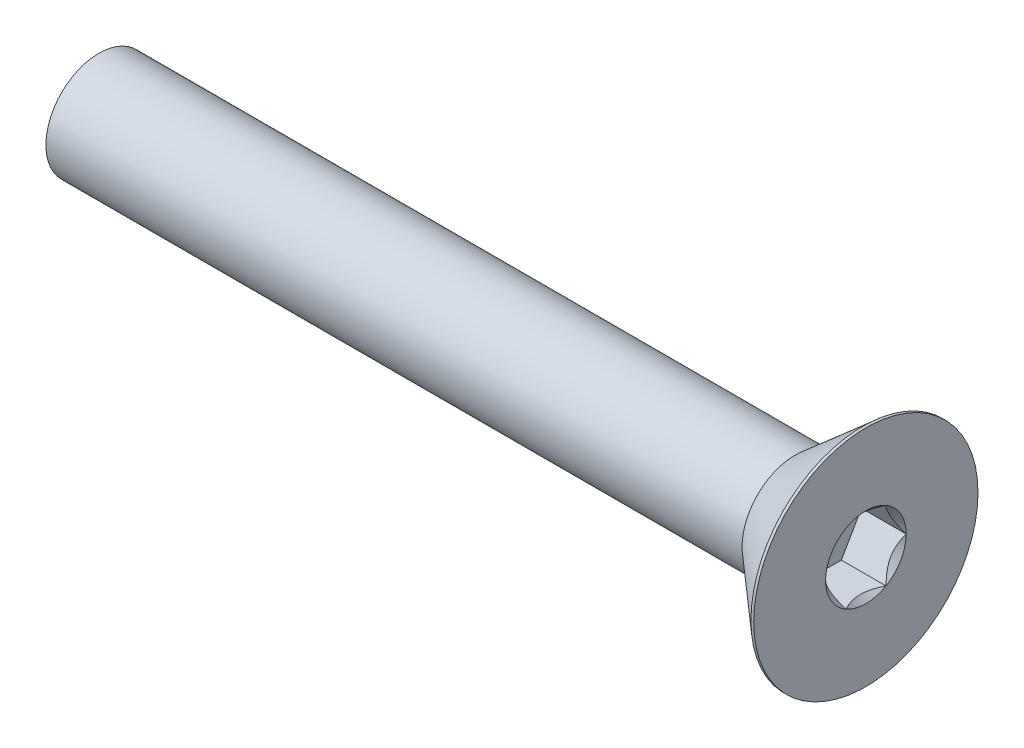
ISO-10303-21;
HEADER;
FILE_DESCRIPTION(('STEP AP214'),'2;1');
FILE_NAME('part.step','',(''),(''),'','','');
FILE_SCHEMA(('AUTOMOTIVE_DESIGN { 1 0 10303 214 1 1 1 1 }'));
ENDSEC;
DATA;
#1=APPLICATION_CONTEXT('core data for automotive mechanical design processes');
#2=APPLICATION_PROTOCOL_DEFINITION('international standard','automotive_design',2000,#1);
#3=PRODUCT_CONTEXT('',#1,'mechanical');
#4=PRODUCT('Part','Part','',(#3));
#5=PRODUCT_RELATED_PRODUCT_CATEGORY('part','',(#4));
#6=PRODUCT_DEFINITION_FORMATION('','',#4);
#7=PRODUCT_DEFINITION_CONTEXT('part definition',#1,'design');
#8=PRODUCT_DEFINITION('design','',#6,#7);
#9=PRODUCT_DEFINITION_SHAPE('','',#8);
#10=(LENGTH_UNIT() NAMED_UNIT(*) SI_UNIT(.MILLI.,.METRE.));
#11=(NAMED_UNIT(*) PLANE_ANGLE_UNIT() SI_UNIT($,.RADIAN.));
#12=(NAMED_UNIT(*) SI_UNIT($,.STERADIAN.) SOLID_ANGLE_UNIT());
#13=UNCERTAINTY_MEASURE_WITH_UNIT(LENGTH_MEASURE(1.E-05),#10,'distance_accuracy_value','');
#14=(GEOMETRIC_REPRESENTATION_CONTEXT(3) GLOBAL_UNCERTAINTY_ASSIGNED_CONTEXT((#13)) GLOBAL_UNIT_ASSIGNED_CONTEXT((#10,
#11,#12)) REPRESENTATION_CONTEXT('',''));
#15=CARTESIAN_POINT('',(0.,0.,0.));
#16=DIRECTION('',(0.,0.,1.));
#17=DIRECTION('',(1.,0.,0.));
#18=AXIS2_PLACEMENT_3D('',#15,#16,#17);
#19=CARTESIAN_POINT('',(1.193712867479,0.,0.));
#20=DIRECTION('',(1.,0.,0.));
#21=DIRECTION('',(0.,0.,-1.));
#22=AXIS2_PLACEMENT_3D('',#19,#20,#21);
#23=PLANE('',#22);
#24=DIRECTION('',(0.,-0.866025403784439,-0.5));
#25=VECTOR('',#24,1.);
#26=CARTESIAN_POINT('',(1.193712867479,-0.79375,1.3748153285078));
#27=LINE('',#26,#25);
#28=CARTESIAN_POINT('',(1.193712867479,0.,1.83308710467706));
#29=VERTEX_POINT('',#28);
#30=CARTESIAN_POINT('',(1.193712867479,-1.5875,0.916543552338532));
#31=VERTEX_POINT('',#30);
#32=EDGE_CURVE('E116',#29,#31,#27,.T.);
#33=ORIENTED_EDGE('',*,*,#32,.T.);
#34=DIRECTION('',(0.,0.,-1.));
#35=VECTOR('',#34,1.);
#36=CARTESIAN_POINT('',(1.193712867479,-1.5875,0.));
#37=LINE('',#36,#35);
#38=CARTESIAN_POINT('',(1.193712867479,-1.5875,-0.91654355233853));
#39=VERTEX_POINT('',#38);
#40=EDGE_CURVE('E83',#31,#39,#37,.T.);
#41=ORIENTED_EDGE('',*,*,#40,.T.);
#42=DIRECTION('',(0.,0.866025403784439,-0.5));
#43=VECTOR('',#42,1.);
#44=CARTESIAN_POINT('',(1.193712867479,-0.79375,-1.3748153285078));
#45=LINE('',#44,#43);
#46=CARTESIAN_POINT('',(1.193712867479,0.,-1.83308710467706));
#47=VERTEX_POINT('',#46);
#48=EDGE_CURVE('E85',#39,#47,#45,.T.);
#49=ORIENTED_EDGE('',*,*,#48,.T.);
#50=DIRECTION('',(0.,0.866025403784438,0.5));
#51=VECTOR('',#50,1.);
#52=CARTESIAN_POINT('',(1.193712867479,0.79375,-1.3748153285078));
#53=LINE('',#52,#51);
#54=CARTESIAN_POINT('',(1.193712867479,1.5875,-0.916543552338529));
#55=VERTEX_POINT('',#54);
#56=EDGE_CURVE('E86',#47,#55,#53,.T.);
#57=ORIENTED_EDGE('',*,*,#56,.T.);
#58=DIRECTION('',(0.,0.,1.));
#59=VECTOR('',#58,1.);
#60=CARTESIAN_POINT('',(1.193712867479,1.5875,0.));
#61=LINE('',#60,#59);
#62=CARTESIAN_POINT('',(1.193712867479,1.5875,0.916543552338531));
#63=VERTEX_POINT('',#62);
#64=EDGE_CURVE('E72',#55,#63,#61,.T.);
#65=ORIENTED_EDGE('',*,*,#64,.T.);
#66=DIRECTION('',(0.,-0.866025403784439,0.5));
#67=VECTOR('',#66,1.);
#68=CARTESIAN_POINT('',(1.193712867479,0.79375,1.3748153285078));
#69=LINE('',#68,#67);
#70=EDGE_CURVE('E111',#63,#29,#69,.T.);
#71=ORIENTED_EDGE('',*,*,#70,.T.);
#72=EDGE_LOOP('',(#33,#41,#49,#57,#65,#71));
#73=FACE_BOUND('',#72,.T.);
#74=ADVANCED_FACE('F18',(#73),#23,.T.);
#75=CARTESIAN_POINT('',(1.193712867479,0.79375,-1.3748153285078));
#76=DIRECTION('',(0.,0.5,-0.866025403784438));
#77=DIRECTION('',(0.,0.866025403784438,0.5));
#78=AXIS2_PLACEMENT_3D('',#75,#76,#77);
#79=PLANE('',#78);
#80=CARTESIAN_POINT('',(3.22571286750186,1.27190366490405E-11,-1.83308710467229));
#81=CARTESIAN_POINT('',(3.19424104986005,0.0545631502739884,-1.80158505517947));
#82=CARTESIAN_POINT('',(3.16461793028213,0.110038597583433,-1.76955629074127));
#83=CARTESIAN_POINT('',(3.11037926295554,0.223158727662726,-1.70424635318872));
#84=CARTESIAN_POINT('',(3.08579388372231,0.280814162284594,-1.67095897248972));
#85=CARTESIAN_POINT('',(3.04367896361078,0.39707351803509,-1.6038366021515));
#86=CARTESIAN_POINT('',(3.0260435970404,0.455647847371345,-1.57001869734156));
#87=CARTESIAN_POINT('',(2.99887295616836,0.574085662108213,-1.50163859312096));
#88=CARTESIAN_POINT('',(2.98931740761292,0.633945532003919,-1.46707848112303));
#89=CARTESIAN_POINT('',(2.98069560936949,0.737116774030597,-1.40751253676631));
#90=CARTESIAN_POINT('',(2.9794196892544,0.780294952191258,-1.38258360398213));
#91=CARTESIAN_POINT('',(2.98157200532222,0.866580665725205,-1.33276652404609));
#92=CARTESIAN_POINT('',(2.98500189035382,0.909688171036207,-1.30787839425069));
#93=CARTESIAN_POINT('',(2.99636918165353,0.995485199884442,-1.25834345654949));
#94=CARTESIAN_POINT('',(3.00431048768001,1.03817432925016,-1.23369687621872));
#95=CARTESIAN_POINT('',(3.02426914428968,1.12283605067518,-1.18481740856393));
#96=CARTESIAN_POINT('',(3.03628824374592,1.16480832716665,-1.16058470343308));
#97=CARTESIAN_POINT('',(3.0719566993385,1.27227527943506,-1.09853862961192));
#98=CARTESIAN_POINT('',(3.0982905750004,1.33710455598761,-1.06110942934294));
#99=CARTESIAN_POINT('',(3.14274348203233,1.43242888424927,-1.00607390276075));
#100=CARTESIAN_POINT('',(3.15836122675727,1.46384120989055,-0.987937988095882));
#101=CARTESIAN_POINT('',(3.19102231805198,1.52608848239935,-0.951999508556608));
#102=CARTESIAN_POINT('',(3.20806498626341,1.55692369555001,-0.934196789943556));
#103=CARTESIAN_POINT('',(3.22571286750293,1.58749999998813,-0.916543552345382));
#104=B_SPLINE_CURVE_WITH_KNOTS('',3,(#80,#81,#82,#83,#84,#85,#86,#87,#88,#89,#90,#91,#92,#93,
#94,#95,#96,#97,#98,#99,#100,#101,#102,#103),.UNSPECIFIED.,.F.,.F.,(4,2,2,2,2,2,2,2,2,2,2,4),
(0.,0.211427927693799,0.42408719707162,0.633370156309493,0.842126401366494,0.991537200904807,
1.14100036528198,1.29059292548924,1.44024972382122,1.67781721399119,1.79627069400735,
1.91466809992471),.UNSPECIFIED.);
#105=CARTESIAN_POINT('',(3.22571286750284,0.,-1.83308710467012));
#106=VERTEX_POINT('',#105);
#107=CARTESIAN_POINT('',(3.22571286750284,1.58749999999399,-0.916543552335056));
#108=VERTEX_POINT('',#107);
#109=EDGE_CURVE('E21',#106,#108,#104,.T.);
#110=ORIENTED_EDGE('',*,*,#109,.T.);
#111=DIRECTION('',(1.,0.,0.));
#112=VECTOR('',#111,1.);
#113=CARTESIAN_POINT('',(1.193712867479,1.5875,-0.916543552338529));
#114=LINE('',#113,#112);
#115=EDGE_CURVE('E91',#108,#55,#114,.F.);
#116=ORIENTED_EDGE('',*,*,#115,.T.);
#117=ORIENTED_EDGE('',*,*,#56,.F.);
#118=DIRECTION('',(1.,0.,0.));
#119=VECTOR('',#118,1.);
#120=CARTESIAN_POINT('',(1.193712867479,0.,-1.83308710467706));
#121=LINE('',#120,#119);
#122=EDGE_CURVE('E59',#47,#106,#121,.T.);
#123=ORIENTED_EDGE('',*,*,#122,.T.);
#124=EDGE_LOOP('',(#110,#116,#117,#123));
#125=FACE_BOUND('',#124,.T.);
#126=ADVANCED_FACE('F90',(#125),#79,.F.);
#127=CARTESIAN_POINT('',(1.193712867479,-0.79375,-1.3748153285078));
#128=DIRECTION('',(0.,-0.5,-0.866025403784439));
#129=DIRECTION('',(0.,0.866025403784439,-0.5));
#130=AXIS2_PLACEMENT_3D('',#127,#128,#129);
#131=PLANE('',#130);
#132=CARTESIAN_POINT('',(3.22571286750053,-1.58749999998325,-0.916543552347617));
#133=CARTESIAN_POINT('',(3.19424104985827,-1.53293684972208,-0.948045601839111));
#134=CARTESIAN_POINT('',(3.16461793028034,-1.47746140241289,-0.980074366276642));
#135=CARTESIAN_POINT('',(3.11037926295412,-1.36434127233427,-1.04538430382841));
#136=CARTESIAN_POINT('',(3.08579388372126,-1.30668583771283,-1.0786716845273));
#137=CARTESIAN_POINT('',(3.04367896361027,-1.19042648196318,-1.14579405486514));
#138=CARTESIAN_POINT('',(3.02604359704007,-1.13185215262735,-1.1796119596748));
#139=CARTESIAN_POINT('',(2.99887295616829,-1.01341433789136,-1.24799206389486));
#140=CARTESIAN_POINT('',(2.98931740761294,-0.9535544679961,-1.28255217589254));
#141=CARTESIAN_POINT('',(2.98069560936951,-0.850383225969922,-1.34211812024898));
#142=CARTESIAN_POINT('',(2.97941968925441,-0.807205047809308,-1.36704705303313));
#143=CARTESIAN_POINT('',(2.98157200532218,-0.720919334275457,-1.41686413296912));
#144=CARTESIAN_POINT('',(2.98500189035375,-0.677811828964505,-1.44175226276449));
#145=CARTESIAN_POINT('',(2.99636918165339,-0.592014800116357,-1.49128720046564));
#146=CARTESIAN_POINT('',(3.00431048767984,-0.549325670750674,-1.51593378079639));
#147=CARTESIAN_POINT('',(3.02426914428943,-0.464663949325729,-1.56481324845114));
#148=CARTESIAN_POINT('',(3.03628824374563,-0.422691672834298,-1.58904595358196));
#149=CARTESIAN_POINT('',(3.07195669933819,-0.315224720565743,-1.6510920274032));
#150=CARTESIAN_POINT('',(3.09829057500013,-0.25039544401301,-1.68852122767229));
#151=CARTESIAN_POINT('',(3.14274348203215,-0.15507111575111,-1.74355675425462));
#152=CARTESIAN_POINT('',(3.15836122675711,-0.123658790109747,-1.76169266891953));
#153=CARTESIAN_POINT('',(3.1910223180519,-0.0614115176007987,-1.7976311484589));
#154=CARTESIAN_POINT('',(3.20806498626337,-0.030576304450065,-1.81543386707199));
#155=CARTESIAN_POINT('',(3.22571286750293,-1.1869329529158E-11,-1.83308710467021));
#156=B_SPLINE_CURVE_WITH_KNOTS('',3,(#132,#133,#134,#135,#136,#137,#138,#139,#140,#141,#142,
#143,#144,#145,#146,#147,#148,#149,#150,#151,#152,#153,#154,#155),.UNSPECIFIED.,.F.,.F.,(4,2,2,
2,2,2,2,2,2,2,2,4),(0.,0.211427927692299,0.424087197068535,0.633370156304816,0.842126401360263,
0.991537200898412,1.14100036527541,1.29059292548253,1.44024972381435,1.67781721398494,
1.79627069400138,1.91466809991902),.UNSPECIFIED.);
#157=CARTESIAN_POINT('',(3.22571286747855,-1.58749999997296,-0.916543552322915));
#158=VERTEX_POINT('',#157);
#159=EDGE_CURVE('E95',#158,#106,#156,.T.);
#160=ORIENTED_EDGE('',*,*,#159,.T.);
#161=ORIENTED_EDGE('',*,*,#122,.F.);
#162=ORIENTED_EDGE('',*,*,#48,.F.);
#163=DIRECTION('',(1.,0.,0.));
#164=VECTOR('',#163,1.);
#165=CARTESIAN_POINT('',(1.193712867479,-1.5875,-0.91654355233853));
#166=LINE('',#165,#164);
#167=EDGE_CURVE('E97',#39,#158,#166,.T.);
#168=ORIENTED_EDGE('',*,*,#167,.T.);
#169=EDGE_LOOP('',(#160,#161,#162,#168));
#170=FACE_BOUND('',#169,.T.);
#171=ADVANCED_FACE('F93',(#170),#131,.F.);
#172=CARTESIAN_POINT('',(1.193712867479,-1.5875,0.));
#173=DIRECTION('',(0.,-1.,0.));
#174=DIRECTION('',(0.,0.,-1.));
#175=AXIS2_PLACEMENT_3D('',#172,#173,#174);
#176=PLANE('',#175);
#177=CARTESIAN_POINT('',(3.22571286750053,-1.5874999999995,0.916543552319482));
#178=CARTESIAN_POINT('',(3.19424104985925,-1.58749999999982,0.853539453324537));
#179=CARTESIAN_POINT('',(3.16461793028281,-1.58749999999995,0.789481924437113));
#180=CARTESIAN_POINT('',(3.11037926296095,-1.58750000000005,0.658862049308573));
#181=CARTESIAN_POINT('',(3.08579388373098,-1.58750000000001,0.592287287898146));
#182=CARTESIAN_POINT('',(3.04367896362744,-1.58749999999999,0.458042547197919));
#183=CARTESIAN_POINT('',(3.02604359706177,-1.5875,0.390406737566707));
#184=CARTESIAN_POINT('',(2.99887295620062,-1.5875,0.253646529103362));
#185=CARTESIAN_POINT('',(2.98931740765138,-1.5875,0.184526305096685));
#186=CARTESIAN_POINT('',(2.9806956094188,-1.5875,0.065394416357588));
#187=CARTESIAN_POINT('',(2.97941968930889,-1.5875,0.0155365507741219));
#188=CARTESIAN_POINT('',(2.98157200538873,-1.5875,-0.0840976091276274));
#189=CARTESIAN_POINT('',(2.98500189042718,-1.5875,-0.133873868732975));
#190=CARTESIAN_POINT('',(2.99636918174179,-1.5875,-0.232943744163808));
#191=CARTESIAN_POINT('',(3.00431048777632,-1.5875,-0.282236904839235));
#192=CARTESIAN_POINT('',(3.02426914440281,-1.5875,-0.379995840175979));
#193=CARTESIAN_POINT('',(3.03628824386782,-1.5875,-0.428461250450951));
#194=CARTESIAN_POINT('',(3.07195669946091,-1.5875,-0.552553398048427));
#195=CARTESIAN_POINT('',(3.09829057510559,-1.5875,-0.62741179853054));
#196=CARTESIAN_POINT('',(3.14274348210285,-1.5875,-0.737482851614946));
#197=CARTESIAN_POINT('',(3.15836122681472,-1.5875,-0.773754680918583));
#198=CARTESIAN_POINT('',(3.19102231808098,-1.5875,-0.845631639946218));
#199=CARTESIAN_POINT('',(3.20806498627704,-1.5875,-0.881237077147509));
#200=CARTESIAN_POINT('',(3.22571286750029,-1.5875,-0.916543552319548));
#201=B_SPLINE_CURVE_WITH_KNOTS('',3,(#177,#178,#179,#180,#181,#182,#183,#184,#185,#186,#187,
#188,#189,#190,#191,#192,#193,#194,#195,#196,#197,#198,#199,#200),.UNSPECIFIED.,.F.,.F.,(4,2,2,
2,2,2,2,2,2,2,2,4),(0.,0.211427927724625,0.424087197133195,0.633370156400541,0.842126401487028,
0.991537201070167,1.14100036549222,1.29059292574443,1.44024972412136,1.67781721411768,
1.79627069404646,1.91466809987682),.UNSPECIFIED.);
#202=CARTESIAN_POINT('',(3.22571286747855,-1.5875,0.916543552338532));
#203=VERTEX_POINT('',#202);
#204=EDGE_CURVE('E191',#203,#158,#201,.T.);
#205=ORIENTED_EDGE('',*,*,#204,.T.);
#206=ORIENTED_EDGE('',*,*,#167,.F.);
#207=ORIENTED_EDGE('',*,*,#40,.F.);
#208=DIRECTION('',(1.,0.,0.));
#209=VECTOR('',#208,1.);
#210=CARTESIAN_POINT('',(1.193712867479,-1.5875,0.916543552338532));
#211=LINE('',#210,#209);
#212=EDGE_CURVE('E113',#31,#203,#211,.T.);
#213=ORIENTED_EDGE('',*,*,#212,.T.);
#214=EDGE_LOOP('',(#205,#206,#207,#213));
#215=FACE_BOUND('',#214,.T.);
#216=ADVANCED_FACE('F200',(#215),#176,.F.);
#217=CARTESIAN_POINT('',(1.193712867479,-0.79375,1.3748153285078));
#218=DIRECTION('',(0.,-0.5,0.866025403784439));
#219=DIRECTION('',(0.,-0.866025403784439,-0.5));
#220=AXIS2_PLACEMENT_3D('',#217,#218,#219);
#221=PLANE('',#220);
#222=CARTESIAN_POINT('',(3.22571286750186,-1.27181945397336E-11,1.8330871046723));
#223=CARTESIAN_POINT('',(3.19424104986005,-0.0545631502739838,1.80158505517947));
#224=CARTESIAN_POINT('',(3.16461793028213,-0.110038597583424,1.76955629074127));
#225=CARTESIAN_POINT('',(3.11037926295555,-0.223158727662709,1.70424635318873));
#226=CARTESIAN_POINT('',(3.08579388372232,-0.280814162284573,1.67095897248974));
#227=CARTESIAN_POINT('',(3.04367896361078,-0.397073518035068,1.60383660215151));
#228=CARTESIAN_POINT('',(3.02604359704041,-0.455647847371328,1.57001869734157));
#229=CARTESIAN_POINT('',(2.99887295616836,-0.574085662108204,1.50163859312097));
#230=CARTESIAN_POINT('',(2.98931740761292,-0.633945532003914,1.46707848112304));
#231=CARTESIAN_POINT('',(2.98069560936948,-0.737116774030598,1.40751253676631));
#232=CARTESIAN_POINT('',(2.9794196892544,-0.780294952191261,1.38258360398213));
#233=CARTESIAN_POINT('',(2.98157200532222,-0.866580665725211,1.33276652404609));
#234=CARTESIAN_POINT('',(2.98500189035382,-0.909688171036214,1.30787839425069));
#235=CARTESIAN_POINT('',(2.99636918165353,-0.995485199884449,1.25834345654949));
#236=CARTESIAN_POINT('',(3.00431048768001,-1.03817432925017,1.23369687621872));
#237=CARTESIAN_POINT('',(3.02426914428968,-1.12283605067518,1.18481740856393));
#238=CARTESIAN_POINT('',(3.03628824374592,-1.16480832716665,1.16058470343308));
#239=CARTESIAN_POINT('',(3.07195669933823,-1.27227527943424,1.0985386296124));
#240=CARTESIAN_POINT('',(3.09829057499975,-1.337104555986,1.06110942934387));
#241=CARTESIAN_POINT('',(3.142743482031,-1.43242888424651,1.00607390276235));
#242=CARTESIAN_POINT('',(3.15836122675569,-1.46384120988742,0.987937988097692));
#243=CARTESIAN_POINT('',(3.19102231804989,-1.52608848239549,0.95199950855884));
#244=CARTESIAN_POINT('',(3.20806498626105,-1.55692369554579,0.934196789945994));
#245=CARTESIAN_POINT('',(3.22571286750029,-1.58749999998356,0.916543552348023));
#246=B_SPLINE_CURVE_WITH_KNOTS('',3,(#222,#223,#224,#225,#226,#227,#228,#229,#230,#231,#232,
#233,#234,#235,#236,#237,#238,#239,#240,#241,#242,#243,#244,#245),.UNSPECIFIED.,.F.,.F.,(4,2,2,
2,2,2,2,2,2,2,2,4),(0.,0.211427927693784,0.42408719707159,0.633370156309478,0.842126401366494,
0.991537200904813,1.14100036528199,1.29059292548925,1.44024972382122,1.67781721398823,
1.79627069400292,1.91466809991882),.UNSPECIFIED.);
#247=CARTESIAN_POINT('',(3.22571286750284,0.,1.83308710467012));
#248=VERTEX_POINT('',#247);
#249=EDGE_CURVE('E184',#248,#203,#246,.T.);
#250=ORIENTED_EDGE('',*,*,#249,.T.);
#251=ORIENTED_EDGE('',*,*,#212,.F.);
#252=ORIENTED_EDGE('',*,*,#32,.F.);
#253=DIRECTION('',(1.,0.,0.));
#254=VECTOR('',#253,1.);
#255=CARTESIAN_POINT('',(1.193712867479,0.,1.83308710467706));
#256=LINE('',#255,#254);
#257=EDGE_CURVE('E108',#29,#248,#256,.T.);
#258=ORIENTED_EDGE('',*,*,#257,.T.);
#259=EDGE_LOOP('',(#250,#251,#252,#258));
#260=FACE_BOUND('',#259,.T.);
#261=ADVANCED_FACE('F196',(#260),#221,.F.);
#262=CARTESIAN_POINT('',(1.193712867479,0.79375,1.3748153285078));
#263=DIRECTION('',(0.,0.5,0.866025403784439));
#264=DIRECTION('',(0.,-0.866025403784439,0.5));
#265=AXIS2_PLACEMENT_3D('',#262,#263,#264);
#266=PLANE('',#265);
#267=CARTESIAN_POINT('',(3.22571286750186,1.58749999998951,0.916543552347163));
#268=CARTESIAN_POINT('',(3.19424104986005,1.53293684972681,0.948045601837517));
#269=CARTESIAN_POINT('',(3.16461793028213,1.47746140241678,0.9800743662747));
#270=CARTESIAN_POINT('',(3.11037926295554,1.36434127233706,1.0453843038265));
#271=CARTESIAN_POINT('',(3.08579388372231,1.30668583771535,1.07867168452577));
#272=CARTESIAN_POINT('',(3.04367896361078,1.19042648196497,1.1457940548642));
#273=CARTESIAN_POINT('',(3.0260435970404,1.13185215262867,1.17961195967406));
#274=CARTESIAN_POINT('',(2.99887295616836,1.01341433789177,1.2479920638946));
#275=CARTESIAN_POINT('',(2.98931740761292,0.953554467996078,1.28255217589255));
#276=CARTESIAN_POINT('',(2.98069560936948,0.850383225969407,1.34211812024929));
#277=CARTESIAN_POINT('',(2.9794196892544,0.807205047808743,1.36704705303346));
#278=CARTESIAN_POINT('',(2.98157200532222,0.720919334274794,1.4168641329695));
#279=CARTESIAN_POINT('',(2.98500189035382,0.677811828963794,1.4417522627649));
#280=CARTESIAN_POINT('',(2.99636918165353,0.592014800115559,1.4912872004661));
#281=CARTESIAN_POINT('',(3.00431048768001,0.549325670749838,1.51593378079687));
#282=CARTESIAN_POINT('',(3.02426914428968,0.464663949324819,1.56481324845166));
#283=CARTESIAN_POINT('',(3.03628824374592,0.422691672833352,1.58904595358251));
#284=CARTESIAN_POINT('',(3.0719566993385,0.315224720564944,1.65109202740367));
#285=CARTESIAN_POINT('',(3.0982905750004,0.250395444012386,1.68852122767266));
#286=CARTESIAN_POINT('',(3.14274348203233,0.155071115750735,1.74355675425484));
#287=CARTESIAN_POINT('',(3.15836122675727,0.123658790109449,1.76169266891971));
#288=CARTESIAN_POINT('',(3.19102231805198,0.0614115176006523,1.79763114845898));
#289=CARTESIAN_POINT('',(3.20806498626341,0.0305763044499931,1.81543386707204));
#290=CARTESIAN_POINT('',(3.22571286750293,1.18705256372643E-11,1.83308710467021));
#291=B_SPLINE_CURVE_WITH_KNOTS('',3,(#267,#268,#269,#270,#271,#272,#273,#274,#275,#276,#277,
#278,#279,#280,#281,#282,#283,#284,#285,#286,#287,#288,#289,#290),.UNSPECIFIED.,.F.,.F.,(4,2,2,
2,2,2,2,2,2,2,2,4),(0.,0.211427927693799,0.42408719707162,0.633370156309492,0.842126401366493,
0.991537200904807,1.14100036528198,1.29059292548924,1.44024972382122,1.67781721399119,
1.79627069400735,1.91466809992471),.UNSPECIFIED.);
#292=CARTESIAN_POINT('',(3.22571286750284,1.58749999999399,0.91654355233506));
#293=VERTEX_POINT('',#292);
#294=EDGE_CURVE('E155',#293,#248,#291,.T.);
#295=ORIENTED_EDGE('',*,*,#294,.T.);
#296=ORIENTED_EDGE('',*,*,#257,.F.);
#297=ORIENTED_EDGE('',*,*,#70,.F.);
#298=DIRECTION('',(1.,0.,0.));
#299=VECTOR('',#298,1.);
#300=CARTESIAN_POINT('',(1.193712867479,1.5875,0.916543552338531));
#301=LINE('',#300,#299);
#302=EDGE_CURVE('E40',#63,#293,#301,.T.);
#303=ORIENTED_EDGE('',*,*,#302,.T.);
#304=EDGE_LOOP('',(#295,#296,#297,#303));
#305=FACE_BOUND('',#304,.T.);
#306=ADVANCED_FACE('F199',(#305),#266,.F.);
#307=CARTESIAN_POINT('',(1.193712867479,1.5875,0.));
#308=DIRECTION('',(0.,1.,0.));
#309=DIRECTION('',(0.,0.,1.));
#310=AXIS2_PLACEMENT_3D('',#307,#308,#309);
#311=PLANE('',#310);
#312=CARTESIAN_POINT('',(3.22571286750186,1.58750000000223,-0.91654355232513));
#313=CARTESIAN_POINT('',(3.19424104986005,1.5875000000008,-0.853539453341949));
#314=CARTESIAN_POINT('',(3.16461793028213,1.58750000000022,-0.789481924466565));
#315=CARTESIAN_POINT('',(3.11037926295554,1.58749999999978,-0.658862049362226));
#316=CARTESIAN_POINT('',(3.08579388372231,1.58749999999994,-0.592287287963956));
#317=CARTESIAN_POINT('',(3.04367896361078,1.58750000000006,-0.4580425472873));
#318=CARTESIAN_POINT('',(3.0260435970404,1.58750000000002,-0.390406737667498));
#319=CARTESIAN_POINT('',(2.99887295616836,1.58749999999999,-0.253646529226359));
#320=CARTESIAN_POINT('',(2.98931740761292,1.5875,-0.184526305230481));
#321=CARTESIAN_POINT('',(2.98069560936949,1.5875,-0.0653944165170242));
#322=CARTESIAN_POINT('',(2.9794196892544,1.5875,-0.0155365509486719));
#323=CARTESIAN_POINT('',(2.98157200532222,1.5875,0.0840976089234156));
#324=CARTESIAN_POINT('',(2.98500189035382,1.5875,0.133873868514215));
#325=CARTESIAN_POINT('',(2.99636918165353,1.5875,0.232943743916612));
#326=CARTESIAN_POINT('',(3.00431048768001,1.5875,0.282236904578152));
#327=CARTESIAN_POINT('',(3.02426914428968,1.5875,0.379995839887736));
#328=CARTESIAN_POINT('',(3.03628824374592,1.5875,0.428461250149434));
#329=CARTESIAN_POINT('',(3.0719566993385,1.5875,0.552553397791743));
#330=CARTESIAN_POINT('',(3.0982905750004,1.5875,0.627411798329719));
#331=CARTESIAN_POINT('',(3.14274348203233,1.5875,0.737482851494088));
#332=CARTESIAN_POINT('',(3.15836122675727,1.5875,0.773754680823825));
#333=CARTESIAN_POINT('',(3.19102231805198,1.5875,0.845631639902373));
#334=CARTESIAN_POINT('',(3.20806498626341,1.5875,0.881237077128478));
#335=CARTESIAN_POINT('',(3.22571286750293,1.5875,0.916543552324826));
#336=B_SPLINE_CURVE_WITH_KNOTS('',3,(#312,#313,#314,#315,#316,#317,#318,#319,#320,#321,#322,
#323,#324,#325,#326,#327,#328,#329,#330,#331,#332,#333,#334,#335),.UNSPECIFIED.,.F.,.F.,(4,2,2,
2,2,2,2,2,2,2,2,4),(0.,0.211427927693799,0.424087197071619,0.633370156309492,0.842126401366492,
0.991537200904806,1.14100036528198,1.29059292548924,1.44024972382121,1.67781721399119,
1.79627069400735,1.91466809992471),.UNSPECIFIED.);
#337=EDGE_CURVE('E148',#108,#293,#336,.T.);
#338=ORIENTED_EDGE('',*,*,#337,.T.);
#339=ORIENTED_EDGE('',*,*,#302,.F.);
#340=ORIENTED_EDGE('',*,*,#64,.F.);
#341=ORIENTED_EDGE('',*,*,#115,.F.);
#342=EDGE_LOOP('',(#338,#339,#340,#341));
#343=FACE_BOUND('',#342,.T.);
#344=ADVANCED_FACE('F162',(#343),#311,.F.);
#345=CARTESIAN_POINT('',(3.22571286739048,0.,0.));
#346=DIRECTION('',(1.,0.,0.));
#347=DIRECTION('',(0.,0.,-1.));
#348=AXIS2_PLACEMENT_3D('',#345,#346,#347);
#349=CONICAL_SURFACE('',#348,1.83308710455776,0.785398163397448);
#350=ORIENTED_EDGE('',*,*,#109,.F.);
#351=CARTESIAN_POINT('',(3.22571286750417,0.,0.));
#352=DIRECTION('',(1.,0.,0.));
#353=DIRECTION('',(0.,0.,-1.));
#354=AXIS2_PLACEMENT_3D('',#351,#352,#353);
#355=CIRCLE('',#354,1.83308710467145);
#356=EDGE_CURVE('E145',#108,#106,#355,.F.);
#357=ORIENTED_EDGE('',*,*,#356,.F.);
#358=EDGE_LOOP('',(#350,#357));
#359=FACE_BOUND('',#358,.T.);
#360=ADVANCED_FACE('F216',(#359),#349,.F.);
#361=CARTESIAN_POINT('',(3.22571286739048,0.,0.));
#362=DIRECTION('',(1.,0.,0.));
#363=DIRECTION('',(0.,0.,-1.));
#364=AXIS2_PLACEMENT_3D('',#361,#362,#363);
#365=CONICAL_SURFACE('',#364,1.83308710455776,0.785398163397448);
#366=ORIENTED_EDGE('',*,*,#159,.F.);
#367=CARTESIAN_POINT('',(3.22571286750417,0.,0.));
#368=DIRECTION('',(1.,0.,0.));
#369=DIRECTION('',(0.,0.,-1.));
#370=AXIS2_PLACEMENT_3D('',#367,#368,#369);
#371=CIRCLE('',#370,1.83308710467145);
#372=EDGE_CURVE('E142',#106,#158,#371,.F.);
#373=ORIENTED_EDGE('',*,*,#372,.F.);
#374=EDGE_LOOP('',(#366,#373));
#375=FACE_BOUND('',#374,.T.);
#376=ADVANCED_FACE('F213',(#375),#365,.F.);
#377=CARTESIAN_POINT('',(3.22571286739048,0.,0.));
#378=DIRECTION('',(1.,0.,0.));
#379=DIRECTION('',(0.,0.,-1.));
#380=AXIS2_PLACEMENT_3D('',#377,#378,#379);
#381=CONICAL_SURFACE('',#380,1.83308710455776,0.785398163512482);
#382=ORIENTED_EDGE('',*,*,#204,.F.);
#383=CARTESIAN_POINT('',(3.22571286744733,0.,0.));
#384=DIRECTION('',(1.,0.,0.));
#385=DIRECTION('',(0.,0.,-1.));
#386=AXIS2_PLACEMENT_3D('',#383,#384,#385);
#387=CIRCLE('',#386,1.83308710461461);
#388=EDGE_CURVE('E139',#158,#203,#387,.F.);
#389=ORIENTED_EDGE('',*,*,#388,.F.);
#390=EDGE_LOOP('',(#382,#389));
#391=FACE_BOUND('',#390,.T.);
#392=ADVANCED_FACE('F180',(#391),#381,.F.);
#393=CARTESIAN_POINT('',(3.22571286739048,0.,0.));
#394=DIRECTION('',(1.,0.,0.));
#395=DIRECTION('',(0.,0.,-1.));
#396=AXIS2_PLACEMENT_3D('',#393,#394,#395);
#397=CONICAL_SURFACE('',#396,1.83308710455776,0.785398163397448);
#398=ORIENTED_EDGE('',*,*,#249,.F.);
#399=CARTESIAN_POINT('',(3.22571286750417,0.,0.));
#400=DIRECTION('',(1.,0.,0.));
#401=DIRECTION('',(0.,0.,-1.));
#402=AXIS2_PLACEMENT_3D('',#399,#400,#401);
#403=CIRCLE('',#402,1.83308710467145);
#404=EDGE_CURVE('E136',#203,#248,#403,.F.);
#405=ORIENTED_EDGE('',*,*,#404,.F.);
#406=EDGE_LOOP('',(#398,#405));
#407=FACE_BOUND('',#406,.T.);
#408=ADVANCED_FACE('F175',(#407),#397,.F.);
#409=CARTESIAN_POINT('',(3.22571286739048,0.,0.));
#410=DIRECTION('',(1.,0.,0.));
#411=DIRECTION('',(0.,0.,-1.));
#412=AXIS2_PLACEMENT_3D('',#409,#410,#411);
#413=CONICAL_SURFACE('',#412,1.83308710455776,0.785398163397448);
#414=ORIENTED_EDGE('',*,*,#294,.F.);
#415=CARTESIAN_POINT('',(3.22571286750417,0.,0.));
#416=DIRECTION('',(1.,0.,0.));
#417=DIRECTION('',(0.,0.,-1.));
#418=AXIS2_PLACEMENT_3D('',#415,#416,#417);
#419=CIRCLE('',#418,1.83308710467145);
#420=EDGE_CURVE('E133',#248,#293,#419,.F.);
#421=ORIENTED_EDGE('',*,*,#420,.F.);
#422=EDGE_LOOP('',(#414,#421));
#423=FACE_BOUND('',#422,.T.);
#424=ADVANCED_FACE('F169',(#423),#413,.F.);
#425=CARTESIAN_POINT('',(3.22571286739048,0.,0.));
#426=DIRECTION('',(1.,0.,0.));
#427=DIRECTION('',(0.,0.,-1.));
#428=AXIS2_PLACEMENT_3D('',#425,#426,#427);
#429=CONICAL_SURFACE('',#428,1.83308710455776,0.785398163397448);
#430=ORIENTED_EDGE('',*,*,#337,.F.);
#431=CARTESIAN_POINT('',(3.22571286750417,0.,0.));
#432=DIRECTION('',(1.,0.,0.));
#433=DIRECTION('',(0.,0.,-1.));
#434=AXIS2_PLACEMENT_3D('',#431,#432,#433);
#435=CIRCLE('',#434,1.83308710467145);
#436=EDGE_CURVE('E130',#293,#108,#435,.F.);
#437=ORIENTED_EDGE('',*,*,#436,.F.);
#438=EDGE_LOOP('',(#430,#437));
#439=FACE_BOUND('',#438,.T.);
#440=ADVANCED_FACE('F164',(#439),#429,.F.);
#441=CARTESIAN_POINT('',(3.225712867479,0.,-5.10667));
#442=DIRECTION('',(1.,0.,0.));
#443=DIRECTION('',(0.,0.,-1.));
#444=AXIS2_PLACEMENT_3D('',#441,#442,#443);
#445=PLANE('',#444);
#446=CARTESIAN_POINT('',(3.225712867479,0.,0.));
#447=DIRECTION('',(1.,0.,0.));
#448=DIRECTION('',(0.,0.,-1.));
#449=AXIS2_PLACEMENT_3D('',#446,#447,#448);
#450=CIRCLE('',#449,5.10667);
#451=CARTESIAN_POINT('',(3.225712867479,0.,-5.10667));
#452=VERTEX_POINT('',#451);
#453=EDGE_CURVE('E127',#452,#452,#450,.F.);
#454=ORIENTED_EDGE('',*,*,#453,.F.);
#455=EDGE_LOOP('',(#454));
#456=FACE_BOUND('',#455,.T.);
#457=ORIENTED_EDGE('',*,*,#420,.T.);
#458=ORIENTED_EDGE('',*,*,#436,.T.);
#459=ORIENTED_EDGE('',*,*,#356,.T.);
#460=ORIENTED_EDGE('',*,*,#372,.T.);
#461=ORIENTED_EDGE('',*,*,#388,.T.);
#462=ORIENTED_EDGE('',*,*,#404,.T.);
#463=EDGE_LOOP('',(#457,#458,#459,#460,#461,#462));
#464=FACE_BOUND('',#463,.T.);
#465=ADVANCED_FACE('F168',(#456,#464),#445,.T.);
#466=CARTESIAN_POINT('',(3.225712867479,0.,0.));
#467=DIRECTION('',(1.,0.,0.));
#468=DIRECTION('',(0.,0.,-1.));
#469=AXIS2_PLACEMENT_3D('',#466,#467,#468);
#470=CYLINDRICAL_SURFACE('',#469,5.10667);
#471=ORIENTED_EDGE('',*,*,#453,.T.);
#472=EDGE_LOOP('',(#471));
#473=FACE_BOUND('',#472,.T.);
#474=CARTESIAN_POINT('',(3.09871286748375,0.,0.));
#475=DIRECTION('',(1.,0.,0.));
#476=DIRECTION('',(0.,0.,-1.));
#477=AXIS2_PLACEMENT_3D('',#474,#475,#476);
#478=CIRCLE('',#477,5.10666999997511);
#479=CARTESIAN_POINT('',(3.09871286748375,0.,-5.10666999997511));
#480=VERTEX_POINT('',#479);
#481=EDGE_CURVE('E126',#480,#480,#478,.F.);
#482=ORIENTED_EDGE('',*,*,#481,.F.);
#483=EDGE_LOOP('',(#482));
#484=FACE_BOUND('',#483,.T.);
#485=ADVANCED_FACE('F240',(#473,#484),#470,.T.);
#486=CARTESIAN_POINT('',(-31.6992,0.,0.));
#487=DIRECTION('',(-1.,0.,0.));
#488=DIRECTION('',(0.,0.,1.));
#489=AXIS2_PLACEMENT_3D('',#486,#487,#488);
#490=PLANE('',#489);
#491=CARTESIAN_POINT('',(-31.6992,0.,0.));
#492=DIRECTION('',(1.,0.,0.));
#493=DIRECTION('',(0.,0.,-1.));
#494=AXIS2_PLACEMENT_3D('',#491,#492,#493);
#495=CIRCLE('',#494,2.413);
#496=CARTESIAN_POINT('',(-31.6992,0.,-2.41300000000001));
#497=VERTEX_POINT('',#496);
#498=EDGE_CURVE('E31',#497,#497,#495,.T.);
#499=ORIENTED_EDGE('',*,*,#498,.F.);
#500=EDGE_LOOP('',(#499));
#501=FACE_BOUND('',#500,.T.);
#502=ADVANCED_FACE('F234',(#501),#490,.T.);
#503=CARTESIAN_POINT('',(3.09871286731322,0.,0.));
#504=DIRECTION('',(1.,0.,0.));
#505=DIRECTION('',(0.,0.,-1.));
#506=AXIS2_PLACEMENT_3D('',#503,#504,#505);
#507=CONICAL_SURFACE('',#506,5.10666999980458,0.71558499331418);
#508=ORIENTED_EDGE('',*,*,#481,.T.);
#509=EDGE_LOOP('',(#508));
#510=FACE_BOUND('',#509,.T.);
#511=CARTESIAN_POINT('',(0.,0.,0.));
#512=DIRECTION('',(1.,0.,0.));
#513=DIRECTION('',(0.,0.,-1.));
#514=AXIS2_PLACEMENT_3D('',#511,#512,#513);
#515=CIRCLE('',#514,2.413);
#516=CARTESIAN_POINT('',(0.,0.,-2.413));
#517=VERTEX_POINT('',#516);
#518=EDGE_CURVE('E11',#517,#517,#515,.F.);
#519=ORIENTED_EDGE('',*,*,#518,.F.);
#520=EDGE_LOOP('',(#519));
#521=FACE_BOUND('',#520,.T.);
#522=ADVANCED_FACE('F228',(#510,#521),#507,.T.);
#523=CARTESIAN_POINT('',(-31.6992,0.,0.));
#524=DIRECTION('',(1.,0.,0.));
#525=DIRECTION('',(0.,0.,-1.));
#526=AXIS2_PLACEMENT_3D('',#523,#524,#525);
#527=CYLINDRICAL_SURFACE('',#526,2.413);
#528=ORIENTED_EDGE('',*,*,#518,.T.);
#529=EDGE_LOOP('',(#528));
#530=FACE_BOUND('',#529,.T.);
#531=ORIENTED_EDGE('',*,*,#498,.T.);
#532=EDGE_LOOP('',(#531));
#533=FACE_BOUND('',#532,.T.);
#534=ADVANCED_FACE('F226',(#530,#533),#527,.T.);
#535=CLOSED_SHELL('',(#74,#126,#171,#216,#261,#306,#344,#360,#376,#392,#408,#424,#440,#465,#485,
#502,#522,#534));
#536=MANIFOLD_SOLID_BREP('B1',#535);
#537=ADVANCED_BREP_SHAPE_REPRESENTATION('',(#18,#536),#14);
#538=SHAPE_DEFINITION_REPRESENTATION(#9,#537);
ENDSEC;
END-ISO-10303-21;
